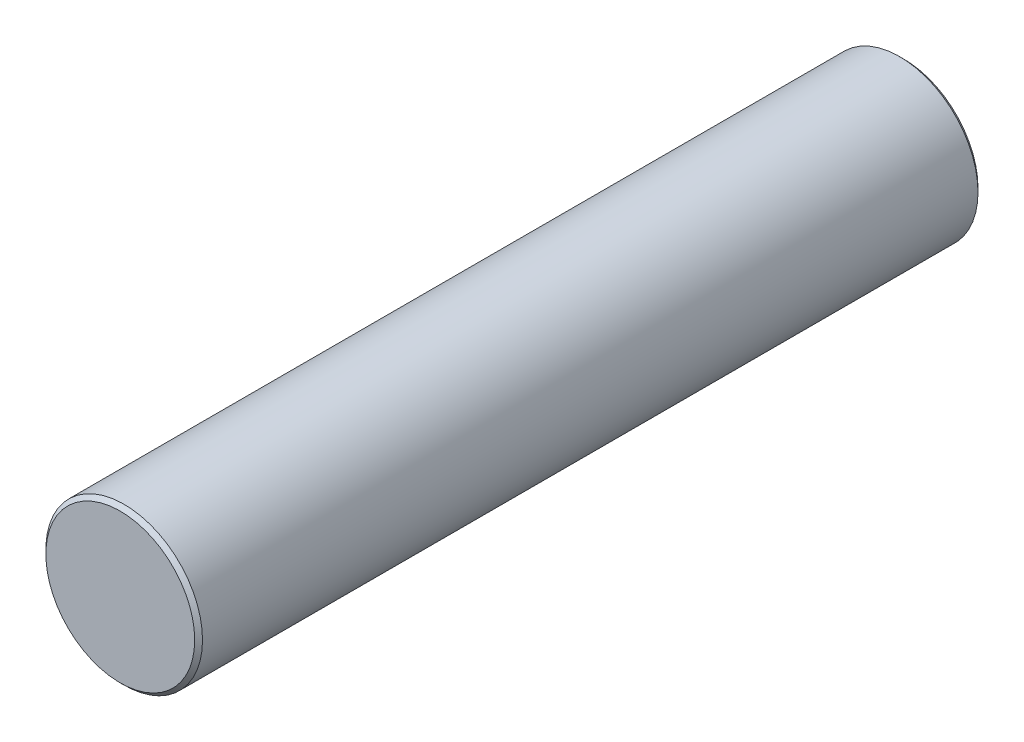
ISO-10303-21;
HEADER;
FILE_DESCRIPTION(('STEP AP214'),'2;1');
FILE_NAME('part.step','',(''),(''),'','','');
FILE_SCHEMA(('AUTOMOTIVE_DESIGN { 1 0 10303 214 1 1 1 1 }'));
ENDSEC;
DATA;
#1=APPLICATION_CONTEXT('core data for automotive mechanical design processes');
#2=APPLICATION_PROTOCOL_DEFINITION('international standard','automotive_design',2000,#1);
#3=PRODUCT_CONTEXT('',#1,'mechanical');
#4=PRODUCT('Part','Part','',(#3));
#5=PRODUCT_RELATED_PRODUCT_CATEGORY('part','',(#4));
#6=PRODUCT_DEFINITION_FORMATION('','',#4);
#7=PRODUCT_DEFINITION_CONTEXT('part definition',#1,'design');
#8=PRODUCT_DEFINITION('design','',#6,#7);
#9=PRODUCT_DEFINITION_SHAPE('','',#8);
#10=(LENGTH_UNIT() NAMED_UNIT(*) SI_UNIT(.MILLI.,.METRE.));
#11=(NAMED_UNIT(*) PLANE_ANGLE_UNIT() SI_UNIT($,.RADIAN.));
#12=(NAMED_UNIT(*) SI_UNIT($,.STERADIAN.) SOLID_ANGLE_UNIT());
#13=UNCERTAINTY_MEASURE_WITH_UNIT(LENGTH_MEASURE(1.E-05),#10,'distance_accuracy_value','');
#14=(GEOMETRIC_REPRESENTATION_CONTEXT(3) GLOBAL_UNCERTAINTY_ASSIGNED_CONTEXT((#13)) GLOBAL_UNIT_ASSIGNED_CONTEXT((#10,
#11,#12)) REPRESENTATION_CONTEXT('',''));
#15=CARTESIAN_POINT('',(0.,0.,0.));
#16=DIRECTION('',(0.,0.,1.));
#17=DIRECTION('',(1.,0.,0.));
#18=AXIS2_PLACEMENT_3D('',#15,#16,#17);
#19=CARTESIAN_POINT('',(0.,0.,200.));
#20=DIRECTION('',(0.,0.,-1.));
#21=DIRECTION('',(-1.,0.,0.));
#22=AXIS2_PLACEMENT_3D('',#19,#20,#21);
#23=CYLINDRICAL_SURFACE('',#22,20.);
#24=CARTESIAN_POINT('',(0.,0.,1.00000000000003));
#25=DIRECTION('',(0.,0.,1.));
#26=DIRECTION('',(1.,0.,0.));
#27=AXIS2_PLACEMENT_3D('',#24,#25,#26);
#28=CIRCLE('',#27,20.);
#29=CARTESIAN_POINT('',(20.,0.,1.00000000000003));
#30=VERTEX_POINT('',#29);
#31=EDGE_CURVE('E45',#30,#30,#28,.T.);
#32=ORIENTED_EDGE('',*,*,#31,.T.);
#33=EDGE_LOOP('',(#32));
#34=FACE_BOUND('',#33,.T.);
#35=CARTESIAN_POINT('',(0.,0.,199.));
#36=DIRECTION('',(0.,0.,1.));
#37=DIRECTION('',(1.,0.,0.));
#38=AXIS2_PLACEMENT_3D('',#35,#36,#37);
#39=CIRCLE('',#38,20.);
#40=CARTESIAN_POINT('',(20.,0.,199.));
#41=VERTEX_POINT('',#40);
#42=EDGE_CURVE('E49',#41,#41,#39,.F.);
#43=ORIENTED_EDGE('',*,*,#42,.T.);
#44=EDGE_LOOP('',(#43));
#45=FACE_BOUND('',#44,.T.);
#46=ADVANCED_FACE('F34',(#34,#45),#23,.T.);
#47=CARTESIAN_POINT('',(0.,0.,200.));
#48=DIRECTION('',(0.,0.,1.));
#49=DIRECTION('',(1.,0.,0.));
#50=AXIS2_PLACEMENT_3D('',#47,#48,#49);
#51=PLANE('',#50);
#52=CARTESIAN_POINT('',(0.,0.,200.));
#53=DIRECTION('',(0.,0.,1.));
#54=DIRECTION('',(1.,0.,0.));
#55=AXIS2_PLACEMENT_3D('',#52,#53,#54);
#56=CIRCLE('',#55,19.);
#57=CARTESIAN_POINT('',(19.,0.,200.));
#58=VERTEX_POINT('',#57);
#59=EDGE_CURVE('E10',#58,#58,#56,.T.);
#60=ORIENTED_EDGE('',*,*,#59,.T.);
#61=EDGE_LOOP('',(#60));
#62=FACE_BOUND('',#61,.T.);
#63=ADVANCED_FACE('F65',(#62),#51,.T.);
#64=CARTESIAN_POINT('',(0.,0.,0.));
#65=DIRECTION('',(0.,0.,1.));
#66=DIRECTION('',(1.,0.,0.));
#67=AXIS2_PLACEMENT_3D('',#64,#65,#66);
#68=PLANE('',#67);
#69=CARTESIAN_POINT('',(0.,0.,0.));
#70=DIRECTION('',(0.,0.,1.));
#71=DIRECTION('',(1.,0.,0.));
#72=AXIS2_PLACEMENT_3D('',#69,#70,#71);
#73=CIRCLE('',#72,19.);
#74=CARTESIAN_POINT('',(19.,0.,0.));
#75=VERTEX_POINT('',#74);
#76=EDGE_CURVE('E41',#75,#75,#73,.F.);
#77=ORIENTED_EDGE('',*,*,#76,.T.);
#78=EDGE_LOOP('',(#77));
#79=FACE_BOUND('',#78,.T.);
#80=ADVANCED_FACE('F62',(#79),#68,.F.);
#81=CARTESIAN_POINT('',(0.,0.,1.00000000000003));
#82=DIRECTION('',(0.,0.,1.));
#83=DIRECTION('',(1.,0.,0.));
#84=AXIS2_PLACEMENT_3D('',#81,#82,#83);
#85=CONICAL_SURFACE('',#84,20.,0.785398163397454);
#86=ORIENTED_EDGE('',*,*,#76,.F.);
#87=EDGE_LOOP('',(#86));
#88=FACE_BOUND('',#87,.T.);
#89=ORIENTED_EDGE('',*,*,#31,.F.);
#90=EDGE_LOOP('',(#89));
#91=FACE_BOUND('',#90,.T.);
#92=ADVANCED_FACE('F58',(#88,#91),#85,.T.);
#93=CARTESIAN_POINT('',(0.,0.,200.));
#94=DIRECTION('',(0.,0.,-1.));
#95=DIRECTION('',(-1.,0.,0.));
#96=AXIS2_PLACEMENT_3D('',#93,#94,#95);
#97=CONICAL_SURFACE('',#96,19.,0.785398163397454);
#98=ORIENTED_EDGE('',*,*,#42,.F.);
#99=EDGE_LOOP('',(#98));
#100=FACE_BOUND('',#99,.T.);
#101=ORIENTED_EDGE('',*,*,#59,.F.);
#102=EDGE_LOOP('',(#101));
#103=FACE_BOUND('',#102,.T.);
#104=ADVANCED_FACE('F36',(#100,#103),#97,.T.);
#105=CLOSED_SHELL('',(#46,#63,#80,#92,#104));
#106=MANIFOLD_SOLID_BREP('B2',#105);
#107=ADVANCED_BREP_SHAPE_REPRESENTATION('',(#18,#106),#14);
#108=SHAPE_DEFINITION_REPRESENTATION(#9,#107);
ENDSEC;
END-ISO-10303-21;
